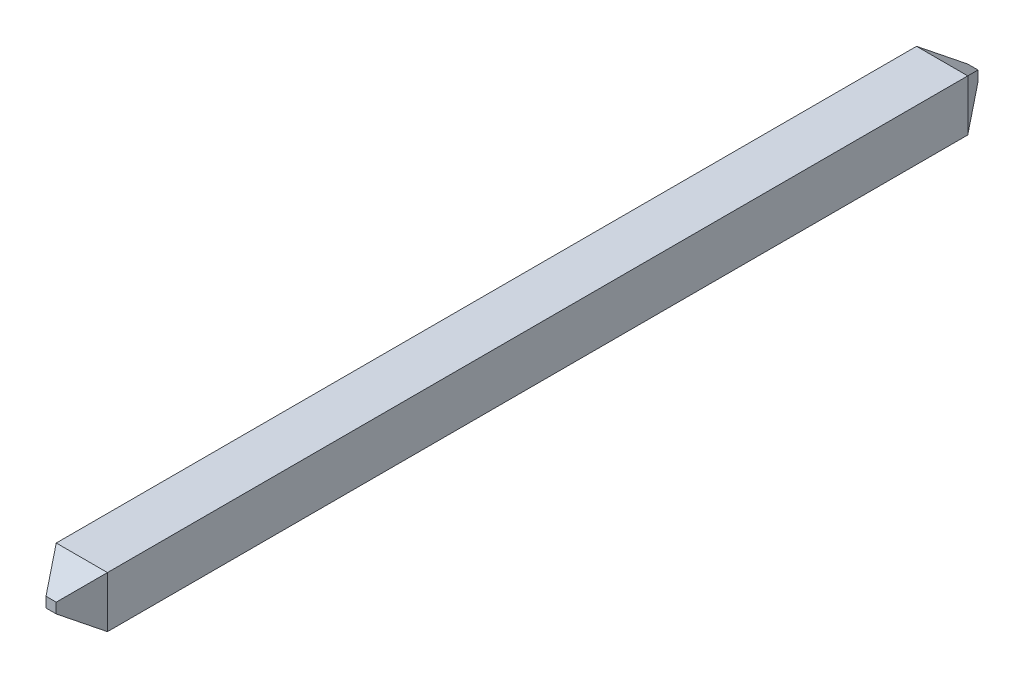
ISO-10303-21;
HEADER;
FILE_DESCRIPTION(('STEP AP214'),'2;1');
FILE_NAME('part.step','',(''),(''),'','','');
FILE_SCHEMA(('AUTOMOTIVE_DESIGN { 1 0 10303 214 1 1 1 1 }'));
ENDSEC;
DATA;
#1=APPLICATION_CONTEXT('core data for automotive mechanical design processes');
#2=APPLICATION_PROTOCOL_DEFINITION('international standard','automotive_design',2000,#1);
#3=PRODUCT_CONTEXT('',#1,'mechanical');
#4=PRODUCT('Part','Part','',(#3));
#5=PRODUCT_RELATED_PRODUCT_CATEGORY('part','',(#4));
#6=PRODUCT_DEFINITION_FORMATION('','',#4);
#7=PRODUCT_DEFINITION_CONTEXT('part definition',#1,'design');
#8=PRODUCT_DEFINITION('design','',#6,#7);
#9=PRODUCT_DEFINITION_SHAPE('','',#8);
#10=(LENGTH_UNIT() NAMED_UNIT(*) SI_UNIT(.MILLI.,.METRE.));
#11=(NAMED_UNIT(*) PLANE_ANGLE_UNIT() SI_UNIT($,.RADIAN.));
#12=(NAMED_UNIT(*) SI_UNIT($,.STERADIAN.) SOLID_ANGLE_UNIT());
#13=UNCERTAINTY_MEASURE_WITH_UNIT(LENGTH_MEASURE(1.E-05),#10,'distance_accuracy_value','');
#14=(GEOMETRIC_REPRESENTATION_CONTEXT(3) GLOBAL_UNCERTAINTY_ASSIGNED_CONTEXT((#13)) GLOBAL_UNIT_ASSIGNED_CONTEXT((#10,
#11,#12)) REPRESENTATION_CONTEXT('',''));
#15=CARTESIAN_POINT('',(0.,0.,0.));
#16=DIRECTION('',(0.,0.,1.));
#17=DIRECTION('',(1.,0.,0.));
#18=AXIS2_PLACEMENT_3D('',#15,#16,#17);
#19=CARTESIAN_POINT('',(0.0635,0.,-6.35));
#20=DIRECTION('',(-0.832050294337843,0.,0.55470019622523));
#21=DIRECTION('',(0.55470019622523,0.,0.832050294337843));
#22=AXIS2_PLACEMENT_3D('',#19,#20,#21);
#23=PLANE('',#22);
#24=DIRECTION('',(0.,1.,0.));
#25=VECTOR('',#24,1.);
#26=CARTESIAN_POINT('',(0.3175,0.3175,-5.969));
#27=LINE('',#26,#25);
#28=CARTESIAN_POINT('',(0.3175,-0.3175,-5.969));
#29=VERTEX_POINT('',#28);
#30=CARTESIAN_POINT('',(0.3175,0.3175,-5.969));
#31=VERTEX_POINT('',#30);
#32=EDGE_CURVE('E103',#29,#31,#27,.T.);
#33=ORIENTED_EDGE('',*,*,#32,.F.);
#34=DIRECTION('',(-0.485071250072667,0.485071250072667,-0.727606875108998));
#35=VECTOR('',#34,1.);
#36=CARTESIAN_POINT('',(0.3175,-0.317500000000001,-5.969));
#37=LINE('',#36,#35);
#38=CARTESIAN_POINT('',(0.0635,-0.063500000000001,-6.35));
#39=VERTEX_POINT('',#38);
#40=EDGE_CURVE('E84',#29,#39,#37,.T.);
#41=ORIENTED_EDGE('',*,*,#40,.T.);
#42=DIRECTION('',(0.,1.,0.));
#43=VECTOR('',#42,1.);
#44=CARTESIAN_POINT('',(0.0635,0.,-6.35));
#45=LINE('',#44,#43);
#46=CARTESIAN_POINT('',(0.0635,0.063500000000001,-6.35));
#47=VERTEX_POINT('',#46);
#48=EDGE_CURVE('E19',#47,#39,#45,.F.);
#49=ORIENTED_EDGE('',*,*,#48,.F.);
#50=DIRECTION('',(0.485071250072667,0.485071250072667,0.727606875108998));
#51=VECTOR('',#50,1.);
#52=CARTESIAN_POINT('',(0.0635,0.063500000000001,-6.35));
#53=LINE('',#52,#51);
#54=EDGE_CURVE('E81',#47,#31,#53,.T.);
#55=ORIENTED_EDGE('',*,*,#54,.T.);
#56=EDGE_LOOP('',(#33,#41,#49,#55));
#57=FACE_BOUND('',#56,.T.);
#58=ADVANCED_FACE('F16',(#57),#23,.F.);
#59=CARTESIAN_POINT('',(0.3175,0.3175,4.699));
#60=DIRECTION('',(0.832050294337844,0.,0.554700196225229));
#61=DIRECTION('',(0.554700196225229,0.,-0.832050294337844));
#62=AXIS2_PLACEMENT_3D('',#59,#60,#61);
#63=PLANE('',#62);
#64=DIRECTION('',(-0.485071250072666,0.485071250072666,0.727606875108999));
#65=VECTOR('',#64,1.);
#66=CARTESIAN_POINT('',(0.3175,-0.3175,4.699));
#67=LINE('',#66,#65);
#68=CARTESIAN_POINT('',(0.3175,-0.3175,4.699));
#69=VERTEX_POINT('',#68);
#70=CARTESIAN_POINT('',(0.0635,-0.0635000000000009,5.08));
#71=VERTEX_POINT('',#70);
#72=EDGE_CURVE('E108',#69,#71,#67,.T.);
#73=ORIENTED_EDGE('',*,*,#72,.F.);
#74=DIRECTION('',(0.,1.,0.));
#75=VECTOR('',#74,1.);
#76=CARTESIAN_POINT('',(0.3175,0.3175,4.699));
#77=LINE('',#76,#75);
#78=CARTESIAN_POINT('',(0.3175,0.3175,4.699));
#79=VERTEX_POINT('',#78);
#80=EDGE_CURVE('E105',#79,#69,#77,.F.);
#81=ORIENTED_EDGE('',*,*,#80,.F.);
#82=DIRECTION('',(0.485071250072666,0.485071250072666,-0.727606875108999));
#83=VECTOR('',#82,1.);
#84=CARTESIAN_POINT('',(0.0635,0.0635000000000005,5.08));
#85=LINE('',#84,#83);
#86=CARTESIAN_POINT('',(0.0635,0.0635000000000008,5.08));
#87=VERTEX_POINT('',#86);
#88=EDGE_CURVE('E115',#87,#79,#85,.T.);
#89=ORIENTED_EDGE('',*,*,#88,.F.);
#90=DIRECTION('',(0.,1.,0.));
#91=VECTOR('',#90,1.);
#92=CARTESIAN_POINT('',(0.0635,0.,5.08));
#93=LINE('',#92,#91);
#94=EDGE_CURVE('E111',#87,#71,#93,.F.);
#95=ORIENTED_EDGE('',*,*,#94,.T.);
#96=EDGE_LOOP('',(#73,#81,#89,#95));
#97=FACE_BOUND('',#96,.T.);
#98=ADVANCED_FACE('F181',(#97),#63,.T.);
#99=CARTESIAN_POINT('',(0.,0.,-6.35));
#100=DIRECTION('',(0.,0.,-1.));
#101=DIRECTION('',(-1.,0.,0.));
#102=AXIS2_PLACEMENT_3D('',#99,#100,#101);
#103=PLANE('',#102);
#104=DIRECTION('',(0.,1.,0.));
#105=VECTOR('',#104,1.);
#106=CARTESIAN_POINT('',(-0.0635,0.,-6.35));
#107=LINE('',#106,#105);
#108=CARTESIAN_POINT('',(-0.0635,-0.063500000000001,-6.35));
#109=VERTEX_POINT('',#108);
#110=CARTESIAN_POINT('',(-0.0635,0.063500000000001,-6.35));
#111=VERTEX_POINT('',#110);
#112=EDGE_CURVE('E90',#109,#111,#107,.T.);
#113=ORIENTED_EDGE('',*,*,#112,.T.);
#114=DIRECTION('',(1.,0.,0.));
#115=VECTOR('',#114,1.);
#116=CARTESIAN_POINT('',(0.,0.063500000000001,-6.35));
#117=LINE('',#116,#115);
#118=EDGE_CURVE('E86',#111,#47,#117,.T.);
#119=ORIENTED_EDGE('',*,*,#118,.T.);
#120=ORIENTED_EDGE('',*,*,#48,.T.);
#121=DIRECTION('',(1.,0.,0.));
#122=VECTOR('',#121,1.);
#123=CARTESIAN_POINT('',(0.,-0.063500000000001,-6.35));
#124=LINE('',#123,#122);
#125=EDGE_CURVE('E98',#39,#109,#124,.F.);
#126=ORIENTED_EDGE('',*,*,#125,.T.);
#127=EDGE_LOOP('',(#113,#119,#120,#126));
#128=FACE_BOUND('',#127,.T.);
#129=ADVANCED_FACE('F88',(#128),#103,.T.);
#130=CARTESIAN_POINT('',(0.,0.063500000000001,-6.35));
#131=DIRECTION('',(0.,-0.832050294337843,0.55470019622523));
#132=DIRECTION('',(0.,-0.55470019622523,-0.832050294337843));
#133=AXIS2_PLACEMENT_3D('',#130,#131,#132);
#134=PLANE('',#133);
#135=DIRECTION('',(1.,0.,0.));
#136=VECTOR('',#135,1.);
#137=CARTESIAN_POINT('',(-0.3175,0.3175,-5.969));
#138=LINE('',#137,#136);
#139=CARTESIAN_POINT('',(-0.3175,0.3175,-5.969));
#140=VERTEX_POINT('',#139);
#141=EDGE_CURVE('E96',#31,#140,#138,.F.);
#142=ORIENTED_EDGE('',*,*,#141,.F.);
#143=ORIENTED_EDGE('',*,*,#54,.F.);
#144=ORIENTED_EDGE('',*,*,#118,.F.);
#145=DIRECTION('',(-0.485071250072667,0.485071250072665,0.727606875108999));
#146=VECTOR('',#145,1.);
#147=CARTESIAN_POINT('',(-0.0635,0.063500000000001,-6.35));
#148=LINE('',#147,#146);
#149=EDGE_CURVE('E131',#111,#140,#148,.T.);
#150=ORIENTED_EDGE('',*,*,#149,.T.);
#151=EDGE_LOOP('',(#142,#143,#144,#150));
#152=FACE_BOUND('',#151,.T.);
#153=ADVANCED_FACE('F94',(#152),#134,.F.);
#154=CARTESIAN_POINT('',(0.,-0.063500000000001,-6.35));
#155=DIRECTION('',(0.,0.832050294337843,0.55470019622523));
#156=DIRECTION('',(0.,-0.55470019622523,0.832050294337843));
#157=AXIS2_PLACEMENT_3D('',#154,#155,#156);
#158=PLANE('',#157);
#159=DIRECTION('',(1.,0.,0.));
#160=VECTOR('',#159,1.);
#161=CARTESIAN_POINT('',(0.3175,-0.3175,-5.969));
#162=LINE('',#161,#160);
#163=CARTESIAN_POINT('',(-0.3175,-0.3175,-5.969));
#164=VERTEX_POINT('',#163);
#165=EDGE_CURVE('E133',#164,#29,#162,.T.);
#166=ORIENTED_EDGE('',*,*,#165,.F.);
#167=DIRECTION('',(0.485071250072667,0.485071250072665,-0.727606875108999));
#168=VECTOR('',#167,1.);
#169=CARTESIAN_POINT('',(-0.3175,-0.3175,-5.969));
#170=LINE('',#169,#168);
#171=EDGE_CURVE('E127',#164,#109,#170,.T.);
#172=ORIENTED_EDGE('',*,*,#171,.T.);
#173=ORIENTED_EDGE('',*,*,#125,.F.);
#174=ORIENTED_EDGE('',*,*,#40,.F.);
#175=EDGE_LOOP('',(#166,#172,#173,#174));
#176=FACE_BOUND('',#175,.T.);
#177=ADVANCED_FACE('F177',(#176),#158,.F.);
#178=CARTESIAN_POINT('',(0.3175,0.3175,5.08));
#179=DIRECTION('',(1.,0.,0.));
#180=DIRECTION('',(0.,0.,-1.));
#181=AXIS2_PLACEMENT_3D('',#178,#179,#180);
#182=PLANE('',#181);
#183=DIRECTION('',(0.,0.,1.));
#184=VECTOR('',#183,1.);
#185=CARTESIAN_POINT('',(0.3175,0.3175,5.08));
#186=LINE('',#185,#184);
#187=EDGE_CURVE('E121',#79,#31,#186,.F.);
#188=ORIENTED_EDGE('',*,*,#187,.F.);
#189=ORIENTED_EDGE('',*,*,#80,.T.);
#190=DIRECTION('',(0.,0.,-1.));
#191=VECTOR('',#190,1.);
#192=CARTESIAN_POINT('',(0.3175,-0.3175,5.08));
#193=LINE('',#192,#191);
#194=EDGE_CURVE('E136',#29,#69,#193,.F.);
#195=ORIENTED_EDGE('',*,*,#194,.F.);
#196=ORIENTED_EDGE('',*,*,#32,.T.);
#197=EDGE_LOOP('',(#188,#189,#195,#196));
#198=FACE_BOUND('',#197,.T.);
#199=ADVANCED_FACE('F179',(#198),#182,.T.);
#200=CARTESIAN_POINT('',(0.3175,-0.3175,4.699));
#201=DIRECTION('',(0.,-0.832050294337844,0.554700196225229));
#202=DIRECTION('',(0.,-0.554700196225229,-0.832050294337844));
#203=AXIS2_PLACEMENT_3D('',#200,#201,#202);
#204=PLANE('',#203);
#205=DIRECTION('',(0.485071250072666,0.485071250072664,0.727606875109));
#206=VECTOR('',#205,1.);
#207=CARTESIAN_POINT('',(-0.3175,-0.3175,4.699));
#208=LINE('',#207,#206);
#209=CARTESIAN_POINT('',(-0.3175,-0.3175,4.699));
#210=VERTEX_POINT('',#209);
#211=CARTESIAN_POINT('',(-0.0635000000000001,-0.0635000000000007,5.08));
#212=VERTEX_POINT('',#211);
#213=EDGE_CURVE('E34',#210,#212,#208,.T.);
#214=ORIENTED_EDGE('',*,*,#213,.F.);
#215=DIRECTION('',(1.,0.,0.));
#216=VECTOR('',#215,1.);
#217=CARTESIAN_POINT('',(0.3175,-0.3175,4.699));
#218=LINE('',#217,#216);
#219=EDGE_CURVE('E139',#69,#210,#218,.F.);
#220=ORIENTED_EDGE('',*,*,#219,.F.);
#221=ORIENTED_EDGE('',*,*,#72,.T.);
#222=DIRECTION('',(-1.,0.,0.));
#223=VECTOR('',#222,1.);
#224=CARTESIAN_POINT('',(0.,-0.063500000000001,5.08));
#225=LINE('',#224,#223);
#226=EDGE_CURVE('E113',#71,#212,#225,.T.);
#227=ORIENTED_EDGE('',*,*,#226,.T.);
#228=EDGE_LOOP('',(#214,#220,#221,#227));
#229=FACE_BOUND('',#228,.T.);
#230=ADVANCED_FACE('F184',(#229),#204,.T.);
#231=CARTESIAN_POINT('',(0.,0.,5.08));
#232=DIRECTION('',(0.,0.,-1.));
#233=DIRECTION('',(-1.,0.,0.));
#234=AXIS2_PLACEMENT_3D('',#231,#232,#233);
#235=PLANE('',#234);
#236=DIRECTION('',(0.,1.,0.));
#237=VECTOR('',#236,1.);
#238=CARTESIAN_POINT('',(-0.0635,-0.3175,5.08));
#239=LINE('',#238,#237);
#240=CARTESIAN_POINT('',(-0.0635,0.0635000000000009,5.08));
#241=VERTEX_POINT('',#240);
#242=EDGE_CURVE('E142',#212,#241,#239,.T.);
#243=ORIENTED_EDGE('',*,*,#242,.F.);
#244=ORIENTED_EDGE('',*,*,#226,.F.);
#245=ORIENTED_EDGE('',*,*,#94,.F.);
#246=DIRECTION('',(1.,0.,0.));
#247=VECTOR('',#246,1.);
#248=CARTESIAN_POINT('',(-0.3175,0.0635000000000005,5.08));
#249=LINE('',#248,#247);
#250=EDGE_CURVE('E118',#241,#87,#249,.T.);
#251=ORIENTED_EDGE('',*,*,#250,.F.);
#252=EDGE_LOOP('',(#243,#244,#245,#251));
#253=FACE_BOUND('',#252,.T.);
#254=ADVANCED_FACE('F186',(#253),#235,.F.);
#255=CARTESIAN_POINT('',(-0.3175,0.3175,4.699));
#256=DIRECTION('',(0.,0.832050294337844,0.554700196225229));
#257=DIRECTION('',(0.,-0.554700196225229,0.832050294337844));
#258=AXIS2_PLACEMENT_3D('',#255,#256,#257);
#259=PLANE('',#258);
#260=DIRECTION('',(-0.485071250072666,0.485071250072664,-0.727606875109));
#261=VECTOR('',#260,1.);
#262=CARTESIAN_POINT('',(-0.0635,0.063500000000001,5.08));
#263=LINE('',#262,#261);
#264=CARTESIAN_POINT('',(-0.3175,0.3175,4.699));
#265=VERTEX_POINT('',#264);
#266=EDGE_CURVE('E145',#241,#265,#263,.T.);
#267=ORIENTED_EDGE('',*,*,#266,.F.);
#268=ORIENTED_EDGE('',*,*,#250,.T.);
#269=ORIENTED_EDGE('',*,*,#88,.T.);
#270=DIRECTION('',(1.,0.,0.));
#271=VECTOR('',#270,1.);
#272=CARTESIAN_POINT('',(-0.3175,0.3175,4.699));
#273=LINE('',#272,#271);
#274=EDGE_CURVE('E124',#265,#79,#273,.T.);
#275=ORIENTED_EDGE('',*,*,#274,.F.);
#276=EDGE_LOOP('',(#267,#268,#269,#275));
#277=FACE_BOUND('',#276,.T.);
#278=ADVANCED_FACE('F168',(#277),#259,.T.);
#279=CARTESIAN_POINT('',(-0.3175,0.3175,5.08));
#280=DIRECTION('',(0.,1.,0.));
#281=DIRECTION('',(0.,0.,1.));
#282=AXIS2_PLACEMENT_3D('',#279,#280,#281);
#283=PLANE('',#282);
#284=DIRECTION('',(0.,0.,1.));
#285=VECTOR('',#284,1.);
#286=CARTESIAN_POINT('',(-0.3175,0.3175,5.08));
#287=LINE('',#286,#285);
#288=EDGE_CURVE('E148',#265,#140,#287,.F.);
#289=ORIENTED_EDGE('',*,*,#288,.F.);
#290=ORIENTED_EDGE('',*,*,#274,.T.);
#291=ORIENTED_EDGE('',*,*,#187,.T.);
#292=ORIENTED_EDGE('',*,*,#141,.T.);
#293=EDGE_LOOP('',(#289,#290,#291,#292));
#294=FACE_BOUND('',#293,.T.);
#295=ADVANCED_FACE('F171',(#294),#283,.T.);
#296=CARTESIAN_POINT('',(-0.0635,0.,-6.35));
#297=DIRECTION('',(0.832050294337843,0.,0.55470019622523));
#298=DIRECTION('',(0.55470019622523,0.,-0.832050294337843));
#299=AXIS2_PLACEMENT_3D('',#296,#297,#298);
#300=PLANE('',#299);
#301=ORIENTED_EDGE('',*,*,#112,.F.);
#302=ORIENTED_EDGE('',*,*,#171,.F.);
#303=DIRECTION('',(0.,1.,0.));
#304=VECTOR('',#303,1.);
#305=CARTESIAN_POINT('',(-0.3175,-0.3175,-5.969));
#306=LINE('',#305,#304);
#307=EDGE_CURVE('E151',#140,#164,#306,.F.);
#308=ORIENTED_EDGE('',*,*,#307,.F.);
#309=ORIENTED_EDGE('',*,*,#149,.F.);
#310=EDGE_LOOP('',(#301,#302,#308,#309));
#311=FACE_BOUND('',#310,.T.);
#312=ADVANCED_FACE('F175',(#311),#300,.F.);
#313=CARTESIAN_POINT('',(0.3175,-0.3175,5.08));
#314=DIRECTION('',(0.,-1.,0.));
#315=DIRECTION('',(0.,0.,-1.));
#316=AXIS2_PLACEMENT_3D('',#313,#314,#315);
#317=PLANE('',#316);
#318=ORIENTED_EDGE('',*,*,#194,.T.);
#319=ORIENTED_EDGE('',*,*,#219,.T.);
#320=DIRECTION('',(0.,0.,1.));
#321=VECTOR('',#320,1.);
#322=CARTESIAN_POINT('',(-0.3175,-0.3175,5.08));
#323=LINE('',#322,#321);
#324=EDGE_CURVE('E25',#164,#210,#323,.T.);
#325=ORIENTED_EDGE('',*,*,#324,.F.);
#326=ORIENTED_EDGE('',*,*,#165,.T.);
#327=EDGE_LOOP('',(#318,#319,#325,#326));
#328=FACE_BOUND('',#327,.T.);
#329=ADVANCED_FACE('F161',(#328),#317,.T.);
#330=CARTESIAN_POINT('',(-0.3175,-0.3175,4.699));
#331=DIRECTION('',(-0.832050294337844,0.,0.554700196225229));
#332=DIRECTION('',(0.554700196225229,0.,0.832050294337844));
#333=AXIS2_PLACEMENT_3D('',#330,#331,#332);
#334=PLANE('',#333);
#335=ORIENTED_EDGE('',*,*,#266,.T.);
#336=DIRECTION('',(0.,1.,0.));
#337=VECTOR('',#336,1.);
#338=CARTESIAN_POINT('',(-0.3175,-0.3175,4.699));
#339=LINE('',#338,#337);
#340=EDGE_CURVE('E11',#210,#265,#339,.T.);
#341=ORIENTED_EDGE('',*,*,#340,.F.);
#342=ORIENTED_EDGE('',*,*,#213,.T.);
#343=ORIENTED_EDGE('',*,*,#242,.T.);
#344=EDGE_LOOP('',(#335,#341,#342,#343));
#345=FACE_BOUND('',#344,.T.);
#346=ADVANCED_FACE('F164',(#345),#334,.T.);
#347=CARTESIAN_POINT('',(-0.3175,-0.3175,5.08));
#348=DIRECTION('',(-1.,0.,0.));
#349=DIRECTION('',(0.,0.,1.));
#350=AXIS2_PLACEMENT_3D('',#347,#348,#349);
#351=PLANE('',#350);
#352=ORIENTED_EDGE('',*,*,#324,.T.);
#353=ORIENTED_EDGE('',*,*,#340,.T.);
#354=ORIENTED_EDGE('',*,*,#288,.T.);
#355=ORIENTED_EDGE('',*,*,#307,.T.);
#356=EDGE_LOOP('',(#352,#353,#354,#355));
#357=FACE_BOUND('',#356,.T.);
#358=ADVANCED_FACE('F157',(#357),#351,.T.);
#359=CLOSED_SHELL('',(#58,#98,#129,#153,#177,#199,#230,#254,#278,#295,#312,#329,#346,#358));
#360=MANIFOLD_SOLID_BREP('B1',#359);
#361=ADVANCED_BREP_SHAPE_REPRESENTATION('',(#18,#360),#14);
#362=SHAPE_DEFINITION_REPRESENTATION(#9,#361);
ENDSEC;
END-ISO-10303-21;
